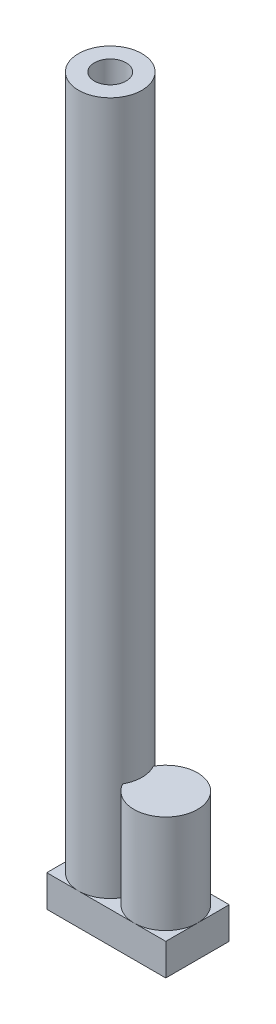
ISO-10303-21;
HEADER;
FILE_DESCRIPTION(('STEP AP214'),'2;1');
FILE_NAME('part.step','',(''),(''),'','','');
FILE_SCHEMA(('AUTOMOTIVE_DESIGN { 1 0 10303 214 1 1 1 1 }'));
ENDSEC;
DATA;
#1=APPLICATION_CONTEXT('core data for automotive mechanical design processes');
#2=APPLICATION_PROTOCOL_DEFINITION('international standard','automotive_design',2000,#1);
#3=PRODUCT_CONTEXT('',#1,'mechanical');
#4=PRODUCT('Part','Part','',(#3));
#5=PRODUCT_RELATED_PRODUCT_CATEGORY('part','',(#4));
#6=PRODUCT_DEFINITION_FORMATION('','',#4);
#7=PRODUCT_DEFINITION_CONTEXT('part definition',#1,'design');
#8=PRODUCT_DEFINITION('design','',#6,#7);
#9=PRODUCT_DEFINITION_SHAPE('','',#8);
#10=(LENGTH_UNIT() NAMED_UNIT(*) SI_UNIT(.MILLI.,.METRE.));
#11=(NAMED_UNIT(*) PLANE_ANGLE_UNIT() SI_UNIT($,.RADIAN.));
#12=(NAMED_UNIT(*) SI_UNIT($,.STERADIAN.) SOLID_ANGLE_UNIT());
#13=UNCERTAINTY_MEASURE_WITH_UNIT(LENGTH_MEASURE(1.E-05),#10,'distance_accuracy_value','');
#14=(GEOMETRIC_REPRESENTATION_CONTEXT(3) GLOBAL_UNCERTAINTY_ASSIGNED_CONTEXT((#13)) GLOBAL_UNIT_ASSIGNED_CONTEXT((#10,
#11,#12)) REPRESENTATION_CONTEXT('',''));
#15=CARTESIAN_POINT('',(0.,0.,0.));
#16=DIRECTION('',(0.,0.,1.));
#17=DIRECTION('',(1.,0.,0.));
#18=AXIS2_PLACEMENT_3D('',#15,#16,#17);
#19=CARTESIAN_POINT('',(0.,457.,0.));
#20=DIRECTION('',(0.,-1.,0.));
#21=DIRECTION('',(0.,0.,-1.));
#22=AXIS2_PLACEMENT_3D('',#19,#20,#21);
#23=CYLINDRICAL_SURFACE('',#22,20.);
#24=CARTESIAN_POINT('',(0.,457.,0.));
#25=DIRECTION('',(0.,1.,0.));
#26=DIRECTION('',(0.,0.,1.));
#27=AXIS2_PLACEMENT_3D('',#24,#25,#26);
#28=CIRCLE('',#27,20.);
#29=CARTESIAN_POINT('',(0.,457.,20.));
#30=VERTEX_POINT('',#29);
#31=EDGE_CURVE('E186',#30,#30,#28,.T.);
#32=ORIENTED_EDGE('',*,*,#31,.F.);
#33=EDGE_LOOP('',(#32));
#34=FACE_BOUND('',#33,.T.);
#35=CARTESIAN_POINT('',(0.,20.,0.));
#36=DIRECTION('',(0.,-1.,0.));
#37=DIRECTION('',(0.,0.,-1.));
#38=AXIS2_PLACEMENT_3D('',#35,#36,#37);
#39=CIRCLE('',#38,20.);
#40=CARTESIAN_POINT('',(0.,20.,-20.));
#41=VERTEX_POINT('',#40);
#42=CARTESIAN_POINT('',(17.5,20.,-9.68245836551854));
#43=VERTEX_POINT('',#42);
#44=EDGE_CURVE('E173',#41,#43,#39,.T.);
#45=ORIENTED_EDGE('',*,*,#44,.F.);
#46=CARTESIAN_POINT('',(-20.,20.,0.));
#47=VERTEX_POINT('',#46);
#48=EDGE_CURVE('E135',#47,#41,#39,.T.);
#49=ORIENTED_EDGE('',*,*,#48,.F.);
#50=CARTESIAN_POINT('',(0.,20.,20.));
#51=VERTEX_POINT('',#50);
#52=EDGE_CURVE('E174',#51,#47,#39,.T.);
#53=ORIENTED_EDGE('',*,*,#52,.F.);
#54=CARTESIAN_POINT('',(17.5,20.,9.68245836551854));
#55=VERTEX_POINT('',#54);
#56=EDGE_CURVE('E171',#55,#51,#39,.T.);
#57=ORIENTED_EDGE('',*,*,#56,.F.);
#58=DIRECTION('',(0.,-1.,0.));
#59=VECTOR('',#58,1.);
#60=CARTESIAN_POINT('',(17.5,41.,9.68245836551854));
#61=LINE('',#60,#59);
#62=CARTESIAN_POINT('',(17.5,82.,9.68245836551854));
#63=VERTEX_POINT('',#62);
#64=EDGE_CURVE('E61',#55,#63,#61,.F.);
#65=ORIENTED_EDGE('',*,*,#64,.T.);
#66=CARTESIAN_POINT('',(0.,82.,0.));
#67=DIRECTION('',(0.,-1.,0.));
#68=DIRECTION('',(0.,0.,-1.));
#69=AXIS2_PLACEMENT_3D('',#66,#67,#68);
#70=CIRCLE('',#69,20.);
#71=CARTESIAN_POINT('',(17.5,82.,-9.68245836551854));
#72=VERTEX_POINT('',#71);
#73=EDGE_CURVE('E188',#72,#63,#70,.T.);
#74=ORIENTED_EDGE('',*,*,#73,.F.);
#75=DIRECTION('',(0.,-1.,0.));
#76=VECTOR('',#75,1.);
#77=CARTESIAN_POINT('',(17.5,41.,-9.68245836551854));
#78=LINE('',#77,#76);
#79=EDGE_CURVE('E179',#72,#43,#78,.T.);
#80=ORIENTED_EDGE('',*,*,#79,.T.);
#81=EDGE_LOOP('',(#45,#49,#53,#57,#65,#74,#80));
#82=FACE_BOUND('',#81,.T.);
#83=ADVANCED_FACE('F37',(#34,#82),#23,.T.);
#84=CARTESIAN_POINT('',(0.,-69.,0.));
#85=DIRECTION('',(0.,1.,0.));
#86=DIRECTION('',(0.,0.,1.));
#87=AXIS2_PLACEMENT_3D('',#84,#85,#86);
#88=CYLINDRICAL_SURFACE('',#87,10.);
#89=CARTESIAN_POINT('',(0.,457.,0.));
#90=DIRECTION('',(0.,1.,0.));
#91=DIRECTION('',(0.,0.,1.));
#92=AXIS2_PLACEMENT_3D('',#89,#90,#91);
#93=CIRCLE('',#92,10.);
#94=CARTESIAN_POINT('',(0.,457.,10.));
#95=VERTEX_POINT('',#94);
#96=EDGE_CURVE('E183',#95,#95,#93,.T.);
#97=ORIENTED_EDGE('',*,*,#96,.T.);
#98=EDGE_LOOP('',(#97));
#99=FACE_BOUND('',#98,.T.);
#100=CARTESIAN_POINT('',(0.,20.,0.));
#101=DIRECTION('',(0.,-1.,0.));
#102=DIRECTION('',(0.,0.,-1.));
#103=AXIS2_PLACEMENT_3D('',#100,#101,#102);
#104=CIRCLE('',#103,10.);
#105=CARTESIAN_POINT('',(0.,20.,-10.));
#106=VERTEX_POINT('',#105);
#107=EDGE_CURVE('E11',#106,#106,#104,.F.);
#108=ORIENTED_EDGE('',*,*,#107,.F.);
#109=EDGE_LOOP('',(#108));
#110=FACE_BOUND('',#109,.T.);
#111=ADVANCED_FACE('F224',(#99,#110),#88,.F.);
#112=CARTESIAN_POINT('',(35.,82.,0.));
#113=DIRECTION('',(0.,-1.,0.));
#114=DIRECTION('',(0.,0.,-1.));
#115=AXIS2_PLACEMENT_3D('',#112,#113,#114);
#116=CYLINDRICAL_SURFACE('',#115,20.);
#117=CARTESIAN_POINT('',(35.,20.,0.));
#118=DIRECTION('',(0.,-1.,0.));
#119=DIRECTION('',(0.,0.,-1.));
#120=AXIS2_PLACEMENT_3D('',#117,#118,#119);
#121=CIRCLE('',#120,20.);
#122=CARTESIAN_POINT('',(55.,20.,0.));
#123=VERTEX_POINT('',#122);
#124=CARTESIAN_POINT('',(35.,20.,-20.));
#125=VERTEX_POINT('',#124);
#126=EDGE_CURVE('E40',#123,#125,#121,.F.);
#127=ORIENTED_EDGE('',*,*,#126,.T.);
#128=EDGE_CURVE('E45',#125,#43,#121,.F.);
#129=ORIENTED_EDGE('',*,*,#128,.T.);
#130=ORIENTED_EDGE('',*,*,#79,.F.);
#131=CARTESIAN_POINT('',(35.,82.,0.));
#132=DIRECTION('',(0.,-1.,0.));
#133=DIRECTION('',(0.,0.,-1.));
#134=AXIS2_PLACEMENT_3D('',#131,#132,#133);
#135=CIRCLE('',#134,20.);
#136=EDGE_CURVE('E176',#72,#63,#135,.T.);
#137=ORIENTED_EDGE('',*,*,#136,.T.);
#138=ORIENTED_EDGE('',*,*,#64,.F.);
#139=CARTESIAN_POINT('',(35.,20.,20.));
#140=VERTEX_POINT('',#139);
#141=EDGE_CURVE('E194',#55,#140,#121,.F.);
#142=ORIENTED_EDGE('',*,*,#141,.T.);
#143=EDGE_CURVE('E191',#140,#123,#121,.F.);
#144=ORIENTED_EDGE('',*,*,#143,.T.);
#145=EDGE_LOOP('',(#127,#129,#130,#137,#138,#142,#144));
#146=FACE_BOUND('',#145,.T.);
#147=ADVANCED_FACE('F197',(#146),#116,.T.);
#148=CARTESIAN_POINT('',(0.,457.,0.));
#149=DIRECTION('',(0.,1.,0.));
#150=DIRECTION('',(0.,0.,1.));
#151=AXIS2_PLACEMENT_3D('',#148,#149,#150);
#152=PLANE('',#151);
#153=ORIENTED_EDGE('',*,*,#96,.F.);
#154=EDGE_LOOP('',(#153));
#155=FACE_BOUND('',#154,.T.);
#156=ORIENTED_EDGE('',*,*,#31,.T.);
#157=EDGE_LOOP('',(#156));
#158=FACE_BOUND('',#157,.T.);
#159=ADVANCED_FACE('F209',(#155,#158),#152,.T.);
#160=CARTESIAN_POINT('',(35.,82.,0.));
#161=DIRECTION('',(0.,-1.,0.));
#162=DIRECTION('',(0.,0.,-1.));
#163=AXIS2_PLACEMENT_3D('',#160,#161,#162);
#164=PLANE('',#163);
#165=ORIENTED_EDGE('',*,*,#136,.F.);
#166=ORIENTED_EDGE('',*,*,#73,.T.);
#167=EDGE_LOOP('',(#165,#166));
#168=FACE_BOUND('',#167,.T.);
#169=ADVANCED_FACE('F207',(#168),#164,.F.);
#170=CARTESIAN_POINT('',(0.,20.,0.));
#171=DIRECTION('',(0.,-1.,0.));
#172=DIRECTION('',(0.,0.,-1.));
#173=AXIS2_PLACEMENT_3D('',#170,#171,#172);
#174=PLANE('',#173);
#175=ORIENTED_EDGE('',*,*,#126,.F.);
#176=DIRECTION('',(0.,0.,1.));
#177=VECTOR('',#176,1.);
#178=CARTESIAN_POINT('',(55.,20.,20.));
#179=LINE('',#178,#177);
#180=CARTESIAN_POINT('',(55.,20.,-20.));
#181=VERTEX_POINT('',#180);
#182=EDGE_CURVE('E139',#181,#123,#179,.T.);
#183=ORIENTED_EDGE('',*,*,#182,.F.);
#184=DIRECTION('',(1.,0.,0.));
#185=VECTOR('',#184,1.);
#186=CARTESIAN_POINT('',(-20.,20.,-20.));
#187=LINE('',#186,#185);
#188=EDGE_CURVE('E138',#125,#181,#187,.T.);
#189=ORIENTED_EDGE('',*,*,#188,.F.);
#190=EDGE_LOOP('',(#175,#183,#189));
#191=FACE_BOUND('',#190,.T.);
#192=ADVANCED_FACE('F155',(#191),#174,.F.);
#193=ORIENTED_EDGE('',*,*,#143,.F.);
#194=DIRECTION('',(-1.,0.,0.));
#195=VECTOR('',#194,1.);
#196=CARTESIAN_POINT('',(-20.,20.,20.));
#197=LINE('',#196,#195);
#198=CARTESIAN_POINT('',(55.,20.,20.));
#199=VERTEX_POINT('',#198);
#200=EDGE_CURVE('E132',#199,#140,#197,.T.);
#201=ORIENTED_EDGE('',*,*,#200,.F.);
#202=EDGE_CURVE('E136',#123,#199,#179,.T.);
#203=ORIENTED_EDGE('',*,*,#202,.F.);
#204=EDGE_LOOP('',(#193,#201,#203));
#205=FACE_BOUND('',#204,.T.);
#206=ADVANCED_FACE('F216',(#205),#174,.F.);
#207=ORIENTED_EDGE('',*,*,#141,.F.);
#208=ORIENTED_EDGE('',*,*,#56,.T.);
#209=EDGE_CURVE('E159',#140,#51,#197,.T.);
#210=ORIENTED_EDGE('',*,*,#209,.F.);
#211=EDGE_LOOP('',(#207,#208,#210));
#212=FACE_BOUND('',#211,.T.);
#213=ADVANCED_FACE('F200',(#212),#174,.F.);
#214=EDGE_CURVE('E53',#41,#125,#187,.T.);
#215=ORIENTED_EDGE('',*,*,#214,.F.);
#216=ORIENTED_EDGE('',*,*,#44,.T.);
#217=ORIENTED_EDGE('',*,*,#128,.F.);
#218=EDGE_LOOP('',(#215,#216,#217));
#219=FACE_BOUND('',#218,.T.);
#220=ADVANCED_FACE('F206',(#219),#174,.F.);
#221=DIRECTION('',(0.,0.,-1.));
#222=VECTOR('',#221,1.);
#223=CARTESIAN_POINT('',(-20.,20.,20.));
#224=LINE('',#223,#222);
#225=CARTESIAN_POINT('',(-20.,20.,-20.));
#226=VERTEX_POINT('',#225);
#227=EDGE_CURVE('E112',#47,#226,#224,.T.);
#228=ORIENTED_EDGE('',*,*,#227,.F.);
#229=ORIENTED_EDGE('',*,*,#48,.T.);
#230=EDGE_CURVE('E128',#226,#41,#187,.T.);
#231=ORIENTED_EDGE('',*,*,#230,.F.);
#232=EDGE_LOOP('',(#228,#229,#231));
#233=FACE_BOUND('',#232,.T.);
#234=ADVANCED_FACE('F134',(#233),#174,.F.);
#235=CARTESIAN_POINT('',(-20.,20.,20.));
#236=VERTEX_POINT('',#235);
#237=EDGE_CURVE('E158',#51,#236,#197,.T.);
#238=ORIENTED_EDGE('',*,*,#237,.F.);
#239=ORIENTED_EDGE('',*,*,#52,.T.);
#240=EDGE_CURVE('E120',#236,#47,#224,.T.);
#241=ORIENTED_EDGE('',*,*,#240,.F.);
#242=EDGE_LOOP('',(#238,#239,#241));
#243=FACE_BOUND('',#242,.T.);
#244=ADVANCED_FACE('F244',(#243),#174,.F.);
#245=CARTESIAN_POINT('',(-20.,20.,-20.));
#246=DIRECTION('',(0.,0.,-1.));
#247=DIRECTION('',(-1.,0.,0.));
#248=AXIS2_PLACEMENT_3D('',#245,#246,#247);
#249=PLANE('',#248);
#250=DIRECTION('',(0.,-1.,0.));
#251=VECTOR('',#250,1.);
#252=CARTESIAN_POINT('',(55.,20.,-20.));
#253=LINE('',#252,#251);
#254=CARTESIAN_POINT('',(55.,0.,-20.));
#255=VERTEX_POINT('',#254);
#256=EDGE_CURVE('E131',#181,#255,#253,.T.);
#257=ORIENTED_EDGE('',*,*,#256,.T.);
#258=DIRECTION('',(1.,0.,0.));
#259=VECTOR('',#258,1.);
#260=CARTESIAN_POINT('',(-20.,0.,-20.));
#261=LINE('',#260,#259);
#262=CARTESIAN_POINT('',(-20.,0.,-20.));
#263=VERTEX_POINT('',#262);
#264=EDGE_CURVE('E130',#263,#255,#261,.T.);
#265=ORIENTED_EDGE('',*,*,#264,.F.);
#266=DIRECTION('',(0.,-1.,0.));
#267=VECTOR('',#266,1.);
#268=CARTESIAN_POINT('',(-20.,20.,-20.));
#269=LINE('',#268,#267);
#270=EDGE_CURVE('E116',#226,#263,#269,.T.);
#271=ORIENTED_EDGE('',*,*,#270,.F.);
#272=ORIENTED_EDGE('',*,*,#230,.T.);
#273=ORIENTED_EDGE('',*,*,#214,.T.);
#274=ORIENTED_EDGE('',*,*,#188,.T.);
#275=EDGE_LOOP('',(#257,#265,#271,#272,#273,#274));
#276=FACE_BOUND('',#275,.T.);
#277=ADVANCED_FACE('F127',(#276),#249,.T.);
#278=CARTESIAN_POINT('',(55.,20.,20.));
#279=DIRECTION('',(1.,0.,0.));
#280=DIRECTION('',(0.,0.,-1.));
#281=AXIS2_PLACEMENT_3D('',#278,#279,#280);
#282=PLANE('',#281);
#283=ORIENTED_EDGE('',*,*,#182,.T.);
#284=ORIENTED_EDGE('',*,*,#202,.T.);
#285=DIRECTION('',(0.,-1.,0.));
#286=VECTOR('',#285,1.);
#287=CARTESIAN_POINT('',(55.,20.,20.));
#288=LINE('',#287,#286);
#289=CARTESIAN_POINT('',(55.,0.,20.));
#290=VERTEX_POINT('',#289);
#291=EDGE_CURVE('E153',#199,#290,#288,.T.);
#292=ORIENTED_EDGE('',*,*,#291,.T.);
#293=DIRECTION('',(0.,0.,1.));
#294=VECTOR('',#293,1.);
#295=CARTESIAN_POINT('',(55.,0.,20.));
#296=LINE('',#295,#294);
#297=EDGE_CURVE('E152',#255,#290,#296,.T.);
#298=ORIENTED_EDGE('',*,*,#297,.F.);
#299=ORIENTED_EDGE('',*,*,#256,.F.);
#300=EDGE_LOOP('',(#283,#284,#292,#298,#299));
#301=FACE_BOUND('',#300,.T.);
#302=ADVANCED_FACE('F148',(#301),#282,.T.);
#303=CARTESIAN_POINT('',(-20.,20.,20.));
#304=DIRECTION('',(0.,0.,1.));
#305=DIRECTION('',(1.,0.,0.));
#306=AXIS2_PLACEMENT_3D('',#303,#304,#305);
#307=PLANE('',#306);
#308=DIRECTION('',(-1.,0.,0.));
#309=VECTOR('',#308,1.);
#310=CARTESIAN_POINT('',(-20.,0.,20.));
#311=LINE('',#310,#309);
#312=CARTESIAN_POINT('',(-20.,0.,20.));
#313=VERTEX_POINT('',#312);
#314=EDGE_CURVE('E124',#290,#313,#311,.T.);
#315=ORIENTED_EDGE('',*,*,#314,.F.);
#316=ORIENTED_EDGE('',*,*,#291,.F.);
#317=ORIENTED_EDGE('',*,*,#200,.T.);
#318=ORIENTED_EDGE('',*,*,#209,.T.);
#319=ORIENTED_EDGE('',*,*,#237,.T.);
#320=DIRECTION('',(0.,-1.,0.));
#321=VECTOR('',#320,1.);
#322=CARTESIAN_POINT('',(-20.,20.,20.));
#323=LINE('',#322,#321);
#324=EDGE_CURVE('E168',#236,#313,#323,.T.);
#325=ORIENTED_EDGE('',*,*,#324,.T.);
#326=EDGE_LOOP('',(#315,#316,#317,#318,#319,#325));
#327=FACE_BOUND('',#326,.T.);
#328=ADVANCED_FACE('F246',(#327),#307,.T.);
#329=CARTESIAN_POINT('',(-20.,20.,20.));
#330=DIRECTION('',(-1.,0.,0.));
#331=DIRECTION('',(0.,0.,1.));
#332=AXIS2_PLACEMENT_3D('',#329,#330,#331);
#333=PLANE('',#332);
#334=ORIENTED_EDGE('',*,*,#270,.T.);
#335=DIRECTION('',(0.,0.,-1.));
#336=VECTOR('',#335,1.);
#337=CARTESIAN_POINT('',(-20.,0.,20.));
#338=LINE('',#337,#336);
#339=EDGE_CURVE('E163',#313,#263,#338,.T.);
#340=ORIENTED_EDGE('',*,*,#339,.F.);
#341=ORIENTED_EDGE('',*,*,#324,.F.);
#342=ORIENTED_EDGE('',*,*,#240,.T.);
#343=ORIENTED_EDGE('',*,*,#227,.T.);
#344=EDGE_LOOP('',(#334,#340,#341,#342,#343));
#345=FACE_BOUND('',#344,.T.);
#346=ADVANCED_FACE('F114',(#345),#333,.T.);
#347=ORIENTED_EDGE('',*,*,#107,.T.);
#348=EDGE_LOOP('',(#347));
#349=FACE_BOUND('',#348,.T.);
#350=ADVANCED_FACE('F218',(#349),#174,.F.);
#351=CARTESIAN_POINT('',(0.,0.,0.));
#352=DIRECTION('',(0.,1.,0.));
#353=DIRECTION('',(0.,0.,1.));
#354=AXIS2_PLACEMENT_3D('',#351,#352,#353);
#355=PLANE('',#354);
#356=ORIENTED_EDGE('',*,*,#264,.T.);
#357=ORIENTED_EDGE('',*,*,#297,.T.);
#358=ORIENTED_EDGE('',*,*,#314,.T.);
#359=ORIENTED_EDGE('',*,*,#339,.T.);
#360=EDGE_LOOP('',(#356,#357,#358,#359));
#361=FACE_BOUND('',#360,.T.);
#362=ADVANCED_FACE('F237',(#361),#355,.F.);
#363=CLOSED_SHELL('',(#83,#111,#147,#159,#169,#192,#206,#213,#220,#234,#244,#277,#302,#328,#346,
#350,#362));
#364=MANIFOLD_SOLID_BREP('B2',#363);
#365=ADVANCED_BREP_SHAPE_REPRESENTATION('',(#18,#364),#14);
#366=SHAPE_DEFINITION_REPRESENTATION(#9,#365);
ENDSEC;
END-ISO-10303-21;
